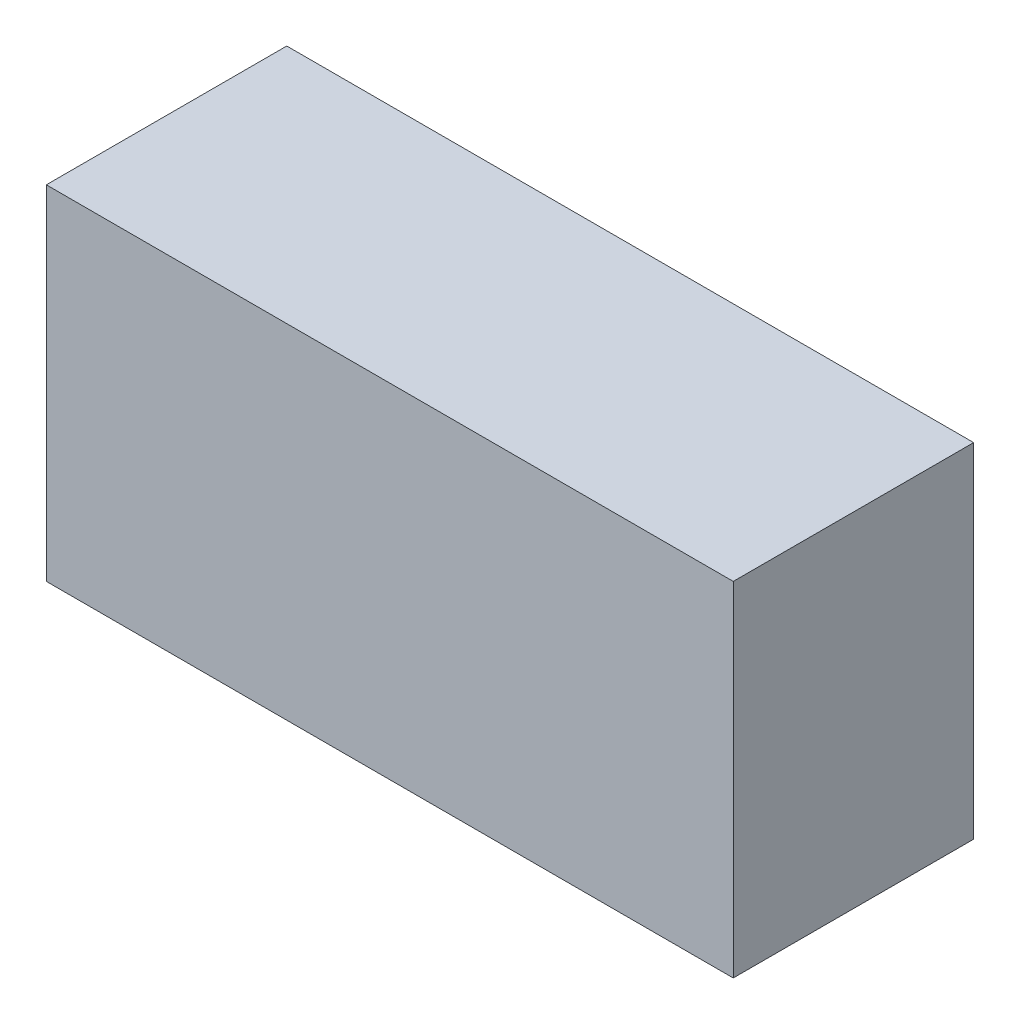
ISO-10303-21;
HEADER;
FILE_DESCRIPTION(('STEP AP214'),'2;1');
FILE_NAME('part.step','',(''),(''),'','','');
FILE_SCHEMA(('AUTOMOTIVE_DESIGN { 1 0 10303 214 1 1 1 1 }'));
ENDSEC;
DATA;
#1=APPLICATION_CONTEXT('core data for automotive mechanical design processes');
#2=APPLICATION_PROTOCOL_DEFINITION('international standard','automotive_design',2000,#1);
#3=PRODUCT_CONTEXT('',#1,'mechanical');
#4=PRODUCT('Part','Part','',(#3));
#5=PRODUCT_RELATED_PRODUCT_CATEGORY('part','',(#4));
#6=PRODUCT_DEFINITION_FORMATION('','',#4);
#7=PRODUCT_DEFINITION_CONTEXT('part definition',#1,'design');
#8=PRODUCT_DEFINITION('design','',#6,#7);
#9=PRODUCT_DEFINITION_SHAPE('','',#8);
#10=(LENGTH_UNIT() NAMED_UNIT(*) SI_UNIT(.MILLI.,.METRE.));
#11=(NAMED_UNIT(*) PLANE_ANGLE_UNIT() SI_UNIT($,.RADIAN.));
#12=(NAMED_UNIT(*) SI_UNIT($,.STERADIAN.) SOLID_ANGLE_UNIT());
#13=UNCERTAINTY_MEASURE_WITH_UNIT(LENGTH_MEASURE(1.E-05),#10,'distance_accuracy_value','');
#14=(GEOMETRIC_REPRESENTATION_CONTEXT(3) GLOBAL_UNCERTAINTY_ASSIGNED_CONTEXT((#13)) GLOBAL_UNIT_ASSIGNED_CONTEXT((#10,
#11,#12)) REPRESENTATION_CONTEXT('',''));
#15=CARTESIAN_POINT('',(0.,0.,0.));
#16=DIRECTION('',(0.,0.,1.));
#17=DIRECTION('',(1.,0.,0.));
#18=AXIS2_PLACEMENT_3D('',#15,#16,#17);
#19=CARTESIAN_POINT('',(-0.5,-0.25,0.35));
#20=DIRECTION('',(1.,0.,0.));
#21=DIRECTION('',(0.,0.,-1.));
#22=AXIS2_PLACEMENT_3D('',#19,#20,#21);
#23=PLANE('',#22);
#24=DIRECTION('',(0.,0.,-1.));
#25=VECTOR('',#24,1.);
#26=CARTESIAN_POINT('',(-0.5,-0.25,0.35));
#27=LINE('',#26,#25);
#28=CARTESIAN_POINT('',(-0.5,-0.25,0.35));
#29=VERTEX_POINT('',#28);
#30=CARTESIAN_POINT('',(-0.5,-0.25,0.));
#31=VERTEX_POINT('',#30);
#32=EDGE_CURVE('E59',#29,#31,#27,.T.);
#33=ORIENTED_EDGE('',*,*,#32,.F.);
#34=DIRECTION('',(0.,1.,0.));
#35=VECTOR('',#34,1.);
#36=CARTESIAN_POINT('',(-0.5,-0.25,0.35));
#37=LINE('',#36,#35);
#38=CARTESIAN_POINT('',(-0.5,0.25,0.35));
#39=VERTEX_POINT('',#38);
#40=EDGE_CURVE('E20',#39,#29,#37,.F.);
#41=ORIENTED_EDGE('',*,*,#40,.F.);
#42=DIRECTION('',(0.,0.,-1.));
#43=VECTOR('',#42,1.);
#44=CARTESIAN_POINT('',(-0.5,0.25,0.35));
#45=LINE('',#44,#43);
#46=CARTESIAN_POINT('',(-0.5,0.25,0.));
#47=VERTEX_POINT('',#46);
#48=EDGE_CURVE('E70',#39,#47,#45,.T.);
#49=ORIENTED_EDGE('',*,*,#48,.T.);
#50=DIRECTION('',(0.,1.,0.));
#51=VECTOR('',#50,1.);
#52=CARTESIAN_POINT('',(-0.5,0.,0.));
#53=LINE('',#52,#51);
#54=EDGE_CURVE('E63',#31,#47,#53,.T.);
#55=ORIENTED_EDGE('',*,*,#54,.F.);
#56=EDGE_LOOP('',(#33,#41,#49,#55));
#57=FACE_BOUND('',#56,.T.);
#58=ADVANCED_FACE('F17',(#57),#23,.F.);
#59=CARTESIAN_POINT('',(0.,0.,0.35));
#60=DIRECTION('',(0.,0.,-1.));
#61=DIRECTION('',(-1.,0.,0.));
#62=AXIS2_PLACEMENT_3D('',#59,#60,#61);
#63=PLANE('',#62);
#64=DIRECTION('',(1.,0.,0.));
#65=VECTOR('',#64,1.);
#66=CARTESIAN_POINT('',(0.5,-0.25,0.35));
#67=LINE('',#66,#65);
#68=CARTESIAN_POINT('',(0.5,-0.25,0.35));
#69=VERTEX_POINT('',#68);
#70=EDGE_CURVE('E56',#29,#69,#67,.T.);
#71=ORIENTED_EDGE('',*,*,#70,.T.);
#72=DIRECTION('',(0.,1.,0.));
#73=VECTOR('',#72,1.);
#74=CARTESIAN_POINT('',(0.5,0.25,0.35));
#75=LINE('',#74,#73);
#76=CARTESIAN_POINT('',(0.5,0.25,0.35));
#77=VERTEX_POINT('',#76);
#78=EDGE_CURVE('E71',#69,#77,#75,.T.);
#79=ORIENTED_EDGE('',*,*,#78,.T.);
#80=DIRECTION('',(1.,0.,0.));
#81=VECTOR('',#80,1.);
#82=CARTESIAN_POINT('',(-0.5,0.25,0.35));
#83=LINE('',#82,#81);
#84=EDGE_CURVE('E53',#77,#39,#83,.F.);
#85=ORIENTED_EDGE('',*,*,#84,.T.);
#86=ORIENTED_EDGE('',*,*,#40,.T.);
#87=EDGE_LOOP('',(#71,#79,#85,#86));
#88=FACE_BOUND('',#87,.T.);
#89=ADVANCED_FACE('F65',(#88),#63,.F.);
#90=CARTESIAN_POINT('',(0.5,0.25,0.35));
#91=DIRECTION('',(-1.,0.,0.));
#92=DIRECTION('',(0.,0.,1.));
#93=AXIS2_PLACEMENT_3D('',#90,#91,#92);
#94=PLANE('',#93);
#95=DIRECTION('',(0.,0.,1.));
#96=VECTOR('',#95,1.);
#97=CARTESIAN_POINT('',(0.5,0.25,0.35));
#98=LINE('',#97,#96);
#99=CARTESIAN_POINT('',(0.5,0.25,0.));
#100=VERTEX_POINT('',#99);
#101=EDGE_CURVE('E75',#77,#100,#98,.F.);
#102=ORIENTED_EDGE('',*,*,#101,.F.);
#103=ORIENTED_EDGE('',*,*,#78,.F.);
#104=DIRECTION('',(0.,0.,1.));
#105=VECTOR('',#104,1.);
#106=CARTESIAN_POINT('',(0.5,-0.25,0.35));
#107=LINE('',#106,#105);
#108=CARTESIAN_POINT('',(0.5,-0.25,0.));
#109=VERTEX_POINT('',#108);
#110=EDGE_CURVE('E61',#69,#109,#107,.F.);
#111=ORIENTED_EDGE('',*,*,#110,.T.);
#112=DIRECTION('',(0.,1.,0.));
#113=VECTOR('',#112,1.);
#114=CARTESIAN_POINT('',(0.5,0.,0.));
#115=LINE('',#114,#113);
#116=EDGE_CURVE('E81',#100,#109,#115,.F.);
#117=ORIENTED_EDGE('',*,*,#116,.F.);
#118=EDGE_LOOP('',(#102,#103,#111,#117));
#119=FACE_BOUND('',#118,.T.);
#120=ADVANCED_FACE('F89',(#119),#94,.F.);
#121=CARTESIAN_POINT('',(0.5,-0.25,0.35));
#122=DIRECTION('',(0.,1.,0.));
#123=DIRECTION('',(0.,0.,1.));
#124=AXIS2_PLACEMENT_3D('',#121,#122,#123);
#125=PLANE('',#124);
#126=DIRECTION('',(-1.,0.,0.));
#127=VECTOR('',#126,1.);
#128=CARTESIAN_POINT('',(0.,-0.25,0.));
#129=LINE('',#128,#127);
#130=EDGE_CURVE('E26',#109,#31,#129,.T.);
#131=ORIENTED_EDGE('',*,*,#130,.F.);
#132=ORIENTED_EDGE('',*,*,#110,.F.);
#133=ORIENTED_EDGE('',*,*,#70,.F.);
#134=ORIENTED_EDGE('',*,*,#32,.T.);
#135=EDGE_LOOP('',(#131,#132,#133,#134));
#136=FACE_BOUND('',#135,.T.);
#137=ADVANCED_FACE('F57',(#136),#125,.F.);
#138=CARTESIAN_POINT('',(-0.5,0.25,0.35));
#139=DIRECTION('',(0.,-1.,0.));
#140=DIRECTION('',(0.,0.,-1.));
#141=AXIS2_PLACEMENT_3D('',#138,#139,#140);
#142=PLANE('',#141);
#143=ORIENTED_EDGE('',*,*,#84,.F.);
#144=ORIENTED_EDGE('',*,*,#101,.T.);
#145=DIRECTION('',(-1.,0.,0.));
#146=VECTOR('',#145,1.);
#147=CARTESIAN_POINT('',(0.,0.25,0.));
#148=LINE('',#147,#146);
#149=EDGE_CURVE('E11',#47,#100,#148,.F.);
#150=ORIENTED_EDGE('',*,*,#149,.F.);
#151=ORIENTED_EDGE('',*,*,#48,.F.);
#152=EDGE_LOOP('',(#143,#144,#150,#151));
#153=FACE_BOUND('',#152,.T.);
#154=ADVANCED_FACE('F91',(#153),#142,.F.);
#155=CARTESIAN_POINT('',(0.,0.,0.));
#156=DIRECTION('',(0.,0.,-1.));
#157=DIRECTION('',(-1.,0.,0.));
#158=AXIS2_PLACEMENT_3D('',#155,#156,#157);
#159=PLANE('',#158);
#160=ORIENTED_EDGE('',*,*,#149,.T.);
#161=ORIENTED_EDGE('',*,*,#116,.T.);
#162=ORIENTED_EDGE('',*,*,#130,.T.);
#163=ORIENTED_EDGE('',*,*,#54,.T.);
#164=EDGE_LOOP('',(#160,#161,#162,#163));
#165=FACE_BOUND('',#164,.T.);
#166=ADVANCED_FACE('F85',(#165),#159,.T.);
#167=CLOSED_SHELL('',(#58,#89,#120,#137,#154,#166));
#168=MANIFOLD_SOLID_BREP('B1',#167);
#169=ADVANCED_BREP_SHAPE_REPRESENTATION('',(#18,#168),#14);
#170=SHAPE_DEFINITION_REPRESENTATION(#9,#169);
ENDSEC;
END-ISO-10303-21;
